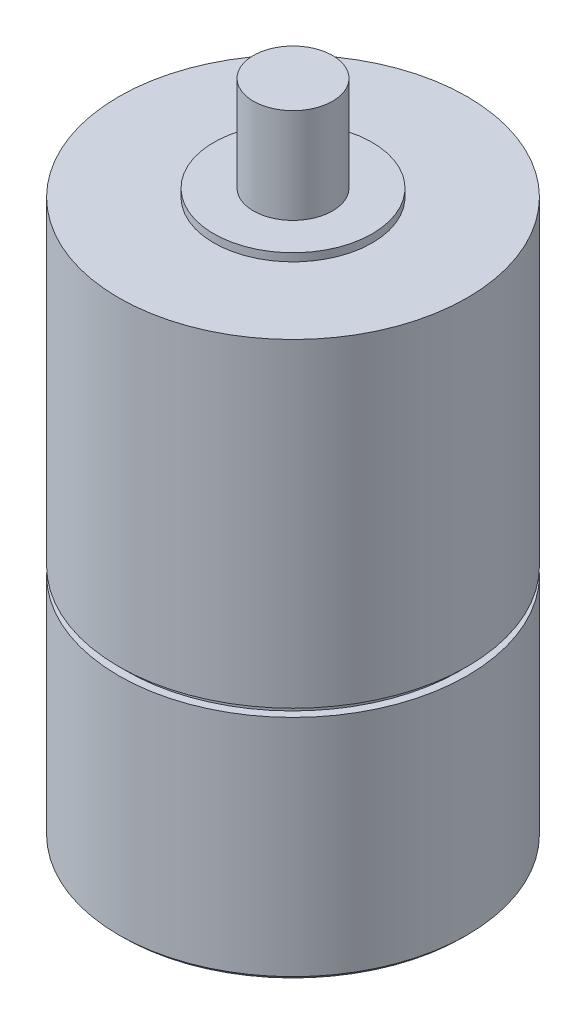
ISO-10303-21;
HEADER;
FILE_DESCRIPTION(('STEP AP214'),'2;1');
FILE_NAME('part.step','',(''),(''),'','','');
FILE_SCHEMA(('AUTOMOTIVE_DESIGN { 1 0 10303 214 1 1 1 1 }'));
ENDSEC;
DATA;
#1=APPLICATION_CONTEXT('core data for automotive mechanical design processes');
#2=APPLICATION_PROTOCOL_DEFINITION('international standard','automotive_design',2000,#1);
#3=PRODUCT_CONTEXT('',#1,'mechanical');
#4=PRODUCT('Part','Part','',(#3));
#5=PRODUCT_RELATED_PRODUCT_CATEGORY('part','',(#4));
#6=PRODUCT_DEFINITION_FORMATION('','',#4);
#7=PRODUCT_DEFINITION_CONTEXT('part definition',#1,'design');
#8=PRODUCT_DEFINITION('design','',#6,#7);
#9=PRODUCT_DEFINITION_SHAPE('','',#8);
#10=(LENGTH_UNIT() NAMED_UNIT(*) SI_UNIT(.MILLI.,.METRE.));
#11=(NAMED_UNIT(*) PLANE_ANGLE_UNIT() SI_UNIT($,.RADIAN.));
#12=(NAMED_UNIT(*) SI_UNIT($,.STERADIAN.) SOLID_ANGLE_UNIT());
#13=UNCERTAINTY_MEASURE_WITH_UNIT(LENGTH_MEASURE(1.E-05),#10,'distance_accuracy_value','');
#14=(GEOMETRIC_REPRESENTATION_CONTEXT(3) GLOBAL_UNCERTAINTY_ASSIGNED_CONTEXT((#13)) GLOBAL_UNIT_ASSIGNED_CONTEXT((#10,
#11,#12)) REPRESENTATION_CONTEXT('',''));
#15=CARTESIAN_POINT('',(0.,0.,0.));
#16=DIRECTION('',(0.,0.,1.));
#17=DIRECTION('',(1.,0.,0.));
#18=AXIS2_PLACEMENT_3D('',#15,#16,#17);
#19=CARTESIAN_POINT('',(0.,20.,0.));
#20=DIRECTION('',(0.,1.,0.));
#21=DIRECTION('',(0.,0.,1.));
#22=AXIS2_PLACEMENT_3D('',#19,#20,#21);
#23=CYLINDRICAL_SURFACE('',#22,5.);
#24=CARTESIAN_POINT('',(0.,85.,0.));
#25=DIRECTION('',(0.,1.,0.));
#26=DIRECTION('',(0.,0.,1.));
#27=AXIS2_PLACEMENT_3D('',#24,#25,#26);
#28=CIRCLE('',#27,5.);
#29=CARTESIAN_POINT('',(5.,85.,0.));
#30=VERTEX_POINT('',#29);
#31=EDGE_CURVE('E63',#30,#30,#28,.T.);
#32=ORIENTED_EDGE('',*,*,#31,.F.);
#33=DIRECTION('',(0.,1.,0.));
#34=VECTOR('',#33,1.);
#35=CARTESIAN_POINT('',(5.,98.,0.));
#36=LINE('',#35,#34);
#37=CARTESIAN_POINT('',(5.,73.,0.));
#38=VERTEX_POINT('',#37);
#39=EDGE_CURVE('E182',#38,#30,#36,.T.);
#40=ORIENTED_EDGE('',*,*,#39,.F.);
#41=CARTESIAN_POINT('',(0.,73.,0.));
#42=DIRECTION('',(0.,1.,0.));
#43=DIRECTION('',(1.,0.,0.));
#44=AXIS2_PLACEMENT_3D('',#41,#42,#43);
#45=CIRCLE('',#44,5.);
#46=EDGE_CURVE('E58',#38,#38,#45,.T.);
#47=ORIENTED_EDGE('',*,*,#46,.T.);
#48=ORIENTED_EDGE('',*,*,#39,.T.);
#49=EDGE_LOOP('',(#32,#40,#47,#48));
#50=FACE_BOUND('',#49,.T.);
#51=ADVANCED_FACE('F48',(#50),#23,.T.);
#52=CARTESIAN_POINT('',(21.5,1.83798327921079,0.));
#53=DIRECTION('',(0.,1.,0.));
#54=DIRECTION('',(0.,0.,1.));
#55=AXIS2_PLACEMENT_3D('',#52,#53,#54);
#56=PLANE('',#55);
#57=CARTESIAN_POINT('',(0.,1.8379832792108,0.));
#58=DIRECTION('',(0.,1.,0.));
#59=DIRECTION('',(1.,0.,0.));
#60=AXIS2_PLACEMENT_3D('',#57,#58,#59);
#61=CIRCLE('',#60,4.99999999999999);
#62=CARTESIAN_POINT('',(4.99999999999999,1.8379832792108,0.));
#63=VERTEX_POINT('',#62);
#64=EDGE_CURVE('E110',#63,#63,#61,.T.);
#65=ORIENTED_EDGE('',*,*,#64,.T.);
#66=EDGE_LOOP('',(#65));
#67=FACE_BOUND('',#66,.T.);
#68=CARTESIAN_POINT('',(0.,1.83798327921079,0.));
#69=DIRECTION('',(0.,1.,0.));
#70=DIRECTION('',(1.,0.,0.));
#71=AXIS2_PLACEMENT_3D('',#68,#69,#70);
#72=CIRCLE('',#71,21.5);
#73=CARTESIAN_POINT('',(21.5,1.83798327921079,0.));
#74=VERTEX_POINT('',#73);
#75=EDGE_CURVE('E112',#74,#74,#72,.T.);
#76=ORIENTED_EDGE('',*,*,#75,.F.);
#77=EDGE_LOOP('',(#76));
#78=FACE_BOUND('',#77,.T.);
#79=ADVANCED_FACE('F108',(#67,#78),#56,.F.);
#80=CARTESIAN_POINT('',(0.,1.83798327921079,0.));
#81=DIRECTION('',(0.,1.,0.));
#82=DIRECTION('',(0.,0.,1.));
#83=AXIS2_PLACEMENT_3D('',#80,#81,#82);
#84=CONICAL_SURFACE('',#83,21.5,0.785398163397421);
#85=DIRECTION('',(0.707106781186529,0.707106781186566,0.));
#86=VECTOR('',#85,1.);
#87=CARTESIAN_POINT('',(22.,2.33798327921082,0.));
#88=LINE('',#87,#86);
#89=CARTESIAN_POINT('',(22.,2.33798327921082,0.));
#90=VERTEX_POINT('',#89);
#91=EDGE_CURVE('E115',#74,#90,#88,.T.);
#92=ORIENTED_EDGE('',*,*,#91,.T.);
#93=CARTESIAN_POINT('',(0.,2.33798327921082,0.));
#94=DIRECTION('',(0.,1.,0.));
#95=DIRECTION('',(1.,0.,0.));
#96=AXIS2_PLACEMENT_3D('',#93,#94,#95);
#97=CIRCLE('',#96,22.);
#98=EDGE_CURVE('E125',#90,#90,#97,.T.);
#99=ORIENTED_EDGE('',*,*,#98,.F.);
#100=ORIENTED_EDGE('',*,*,#91,.F.);
#101=ORIENTED_EDGE('',*,*,#75,.T.);
#102=EDGE_LOOP('',(#92,#99,#100,#101));
#103=FACE_BOUND('',#102,.T.);
#104=ADVANCED_FACE('F211',(#103),#84,.T.);
#105=CARTESIAN_POINT('',(0.,20.,0.));
#106=DIRECTION('',(0.,1.,0.));
#107=DIRECTION('',(0.,0.,1.));
#108=AXIS2_PLACEMENT_3D('',#105,#106,#107);
#109=CYLINDRICAL_SURFACE('',#108,22.);
#110=DIRECTION('',(0.,1.,0.));
#111=VECTOR('',#110,1.);
#112=CARTESIAN_POINT('',(22.,30.6815136852996,0.));
#113=LINE('',#112,#111);
#114=CARTESIAN_POINT('',(22.,30.6815136852996,0.));
#115=VERTEX_POINT('',#114);
#116=EDGE_CURVE('E119',#90,#115,#113,.T.);
#117=ORIENTED_EDGE('',*,*,#116,.T.);
#118=CARTESIAN_POINT('',(0.,30.6815136852996,0.));
#119=DIRECTION('',(0.,1.,0.));
#120=DIRECTION('',(1.,0.,0.));
#121=AXIS2_PLACEMENT_3D('',#118,#119,#120);
#122=CIRCLE('',#121,22.);
#123=EDGE_CURVE('E131',#115,#115,#122,.T.);
#124=ORIENTED_EDGE('',*,*,#123,.F.);
#125=ORIENTED_EDGE('',*,*,#116,.F.);
#126=ORIENTED_EDGE('',*,*,#98,.T.);
#127=EDGE_LOOP('',(#117,#124,#125,#126));
#128=FACE_BOUND('',#127,.T.);
#129=ADVANCED_FACE('F236',(#128),#109,.T.);
#130=CARTESIAN_POINT('',(21.,30.6815136852996,0.));
#131=DIRECTION('',(0.,-1.,0.));
#132=DIRECTION('',(0.,0.,-1.));
#133=AXIS2_PLACEMENT_3D('',#130,#131,#132);
#134=PLANE('',#133);
#135=ORIENTED_EDGE('',*,*,#123,.T.);
#136=EDGE_LOOP('',(#135));
#137=FACE_BOUND('',#136,.T.);
#138=CARTESIAN_POINT('',(0.,30.6815136852996,0.));
#139=DIRECTION('',(0.,1.,0.));
#140=DIRECTION('',(1.,0.,0.));
#141=AXIS2_PLACEMENT_3D('',#138,#139,#140);
#142=CIRCLE('',#141,21.);
#143=CARTESIAN_POINT('',(21.,30.6815136852996,0.));
#144=VERTEX_POINT('',#143);
#145=EDGE_CURVE('E138',#144,#144,#142,.T.);
#146=ORIENTED_EDGE('',*,*,#145,.F.);
#147=EDGE_LOOP('',(#146));
#148=FACE_BOUND('',#147,.T.);
#149=ADVANCED_FACE('F232',(#137,#148),#134,.F.);
#150=CARTESIAN_POINT('',(0.,20.,0.));
#151=DIRECTION('',(0.,1.,0.));
#152=DIRECTION('',(0.,0.,1.));
#153=AXIS2_PLACEMENT_3D('',#150,#151,#152);
#154=CYLINDRICAL_SURFACE('',#153,21.);
#155=DIRECTION('',(0.,1.,0.));
#156=VECTOR('',#155,1.);
#157=CARTESIAN_POINT('',(21.,31.6815136852996,0.));
#158=LINE('',#157,#156);
#159=CARTESIAN_POINT('',(21.,31.6815136852996,0.));
#160=VERTEX_POINT('',#159);
#161=EDGE_CURVE('E141',#144,#160,#158,.T.);
#162=ORIENTED_EDGE('',*,*,#161,.T.);
#163=CARTESIAN_POINT('',(0.,31.6815136852996,0.));
#164=DIRECTION('',(0.,1.,0.));
#165=DIRECTION('',(1.,0.,0.));
#166=AXIS2_PLACEMENT_3D('',#163,#164,#165);
#167=CIRCLE('',#166,21.);
#168=EDGE_CURVE('E145',#160,#160,#167,.T.);
#169=ORIENTED_EDGE('',*,*,#168,.F.);
#170=ORIENTED_EDGE('',*,*,#161,.F.);
#171=ORIENTED_EDGE('',*,*,#145,.T.);
#172=EDGE_LOOP('',(#162,#169,#170,#171));
#173=FACE_BOUND('',#172,.T.);
#174=ADVANCED_FACE('F228',(#173),#154,.T.);
#175=CARTESIAN_POINT('',(22.,31.6815136852996,0.));
#176=DIRECTION('',(0.,1.,0.));
#177=DIRECTION('',(0.,0.,1.));
#178=AXIS2_PLACEMENT_3D('',#175,#176,#177);
#179=PLANE('',#178);
#180=ORIENTED_EDGE('',*,*,#168,.T.);
#181=EDGE_LOOP('',(#180));
#182=FACE_BOUND('',#181,.T.);
#183=CARTESIAN_POINT('',(0.,31.6815136852996,0.));
#184=DIRECTION('',(0.,1.,0.));
#185=DIRECTION('',(1.,0.,0.));
#186=AXIS2_PLACEMENT_3D('',#183,#184,#185);
#187=CIRCLE('',#186,22.);
#188=CARTESIAN_POINT('',(22.,31.6815136852996,0.));
#189=VERTEX_POINT('',#188);
#190=EDGE_CURVE('E152',#189,#189,#187,.T.);
#191=ORIENTED_EDGE('',*,*,#190,.F.);
#192=EDGE_LOOP('',(#191));
#193=FACE_BOUND('',#192,.T.);
#194=ADVANCED_FACE('F224',(#182,#193),#179,.F.);
#195=CARTESIAN_POINT('',(0.,20.,0.));
#196=DIRECTION('',(0.,1.,0.));
#197=DIRECTION('',(0.,0.,1.));
#198=AXIS2_PLACEMENT_3D('',#195,#196,#197);
#199=CYLINDRICAL_SURFACE('',#198,22.);
#200=DIRECTION('',(0.,1.,0.));
#201=VECTOR('',#200,1.);
#202=CARTESIAN_POINT('',(22.,72.,0.));
#203=LINE('',#202,#201);
#204=CARTESIAN_POINT('',(22.,72.,0.));
#205=VERTEX_POINT('',#204);
#206=EDGE_CURVE('E155',#189,#205,#203,.T.);
#207=ORIENTED_EDGE('',*,*,#206,.T.);
#208=CARTESIAN_POINT('',(0.,72.,0.));
#209=DIRECTION('',(0.,1.,0.));
#210=DIRECTION('',(1.,0.,0.));
#211=AXIS2_PLACEMENT_3D('',#208,#209,#210);
#212=CIRCLE('',#211,22.);
#213=EDGE_CURVE('E159',#205,#205,#212,.T.);
#214=ORIENTED_EDGE('',*,*,#213,.F.);
#215=ORIENTED_EDGE('',*,*,#206,.F.);
#216=ORIENTED_EDGE('',*,*,#190,.T.);
#217=EDGE_LOOP('',(#207,#214,#215,#216));
#218=FACE_BOUND('',#217,.T.);
#219=ADVANCED_FACE('F220',(#218),#199,.T.);
#220=CARTESIAN_POINT('',(10.,72.,0.));
#221=DIRECTION('',(0.,-1.,0.));
#222=DIRECTION('',(0.,0.,-1.));
#223=AXIS2_PLACEMENT_3D('',#220,#221,#222);
#224=PLANE('',#223);
#225=ORIENTED_EDGE('',*,*,#213,.T.);
#226=EDGE_LOOP('',(#225));
#227=FACE_BOUND('',#226,.T.);
#228=CARTESIAN_POINT('',(0.,72.,0.));
#229=DIRECTION('',(0.,1.,0.));
#230=DIRECTION('',(1.,0.,0.));
#231=AXIS2_PLACEMENT_3D('',#228,#229,#230);
#232=CIRCLE('',#231,10.);
#233=CARTESIAN_POINT('',(10.,72.,0.));
#234=VERTEX_POINT('',#233);
#235=EDGE_CURVE('E166',#234,#234,#232,.T.);
#236=ORIENTED_EDGE('',*,*,#235,.F.);
#237=EDGE_LOOP('',(#236));
#238=FACE_BOUND('',#237,.T.);
#239=ADVANCED_FACE('F216',(#227,#238),#224,.F.);
#240=CARTESIAN_POINT('',(0.,20.,0.));
#241=DIRECTION('',(0.,1.,0.));
#242=DIRECTION('',(0.,0.,1.));
#243=AXIS2_PLACEMENT_3D('',#240,#241,#242);
#244=CYLINDRICAL_SURFACE('',#243,10.);
#245=DIRECTION('',(0.,1.,0.));
#246=VECTOR('',#245,1.);
#247=CARTESIAN_POINT('',(10.,73.,0.));
#248=LINE('',#247,#246);
#249=CARTESIAN_POINT('',(10.,73.,0.));
#250=VERTEX_POINT('',#249);
#251=EDGE_CURVE('E169',#234,#250,#248,.T.);
#252=ORIENTED_EDGE('',*,*,#251,.T.);
#253=CARTESIAN_POINT('',(0.,73.,0.));
#254=DIRECTION('',(0.,1.,0.));
#255=DIRECTION('',(1.,0.,0.));
#256=AXIS2_PLACEMENT_3D('',#253,#254,#255);
#257=CIRCLE('',#256,10.);
#258=EDGE_CURVE('E173',#250,#250,#257,.T.);
#259=ORIENTED_EDGE('',*,*,#258,.F.);
#260=ORIENTED_EDGE('',*,*,#251,.F.);
#261=ORIENTED_EDGE('',*,*,#235,.T.);
#262=EDGE_LOOP('',(#252,#259,#260,#261));
#263=FACE_BOUND('',#262,.T.);
#264=ADVANCED_FACE('F202',(#263),#244,.T.);
#265=CARTESIAN_POINT('',(5.,73.,0.));
#266=DIRECTION('',(0.,-1.,0.));
#267=DIRECTION('',(0.,0.,-1.));
#268=AXIS2_PLACEMENT_3D('',#265,#266,#267);
#269=PLANE('',#268);
#270=ORIENTED_EDGE('',*,*,#258,.T.);
#271=EDGE_LOOP('',(#270));
#272=FACE_BOUND('',#271,.T.);
#273=ORIENTED_EDGE('',*,*,#46,.F.);
#274=EDGE_LOOP('',(#273));
#275=FACE_BOUND('',#274,.T.);
#276=ADVANCED_FACE('F196',(#272,#275),#269,.F.);
#277=CARTESIAN_POINT('',(4.99999999999999,0.,0.));
#278=DIRECTION('',(0.,1.,0.));
#279=DIRECTION('',(0.,0.,1.));
#280=AXIS2_PLACEMENT_3D('',#277,#278,#279);
#281=PLANE('',#280);
#282=CARTESIAN_POINT('',(0.,0.,0.));
#283=DIRECTION('',(0.,1.,0.));
#284=DIRECTION('',(1.,0.,0.));
#285=AXIS2_PLACEMENT_3D('',#282,#283,#284);
#286=CIRCLE('',#285,4.99999999999999);
#287=CARTESIAN_POINT('',(4.99999999999999,0.,0.));
#288=VERTEX_POINT('',#287);
#289=EDGE_CURVE('E12',#288,#288,#286,.T.);
#290=ORIENTED_EDGE('',*,*,#289,.F.);
#291=EDGE_LOOP('',(#290));
#292=FACE_BOUND('',#291,.T.);
#293=ADVANCED_FACE('F194',(#292),#281,.F.);
#294=CARTESIAN_POINT('',(0.,20.,0.));
#295=DIRECTION('',(0.,1.,0.));
#296=DIRECTION('',(0.,0.,1.));
#297=AXIS2_PLACEMENT_3D('',#294,#295,#296);
#298=CYLINDRICAL_SURFACE('',#297,4.99999999999999);
#299=DIRECTION('',(0.,1.,0.));
#300=VECTOR('',#299,1.);
#301=CARTESIAN_POINT('',(4.99999999999999,1.8379832792108,0.));
#302=LINE('',#301,#300);
#303=EDGE_CURVE('E52',#288,#63,#302,.T.);
#304=ORIENTED_EDGE('',*,*,#303,.T.);
#305=ORIENTED_EDGE('',*,*,#64,.F.);
#306=ORIENTED_EDGE('',*,*,#303,.F.);
#307=ORIENTED_EDGE('',*,*,#289,.T.);
#308=EDGE_LOOP('',(#304,#305,#306,#307));
#309=FACE_BOUND('',#308,.T.);
#310=ADVANCED_FACE('F50',(#309),#298,.T.);
#311=CARTESIAN_POINT('',(0.,85.,0.));
#312=DIRECTION('',(0.,1.,0.));
#313=DIRECTION('',(0.,0.,1.));
#314=AXIS2_PLACEMENT_3D('',#311,#312,#313);
#315=PLANE('',#314);
#316=ORIENTED_EDGE('',*,*,#31,.T.);
#317=EDGE_LOOP('',(#316));
#318=FACE_BOUND('',#317,.T.);
#319=ADVANCED_FACE('F201',(#318),#315,.T.);
#320=CLOSED_SHELL('',(#51,#79,#104,#129,#149,#174,#194,#219,#239,#264,#276,#293,#310,#319));
#321=MANIFOLD_SOLID_BREP('B2',#320);
#322=ADVANCED_BREP_SHAPE_REPRESENTATION('',(#18,#321),#14);
#323=SHAPE_DEFINITION_REPRESENTATION(#9,#322);
ENDSEC;
END-ISO-10303-21;
